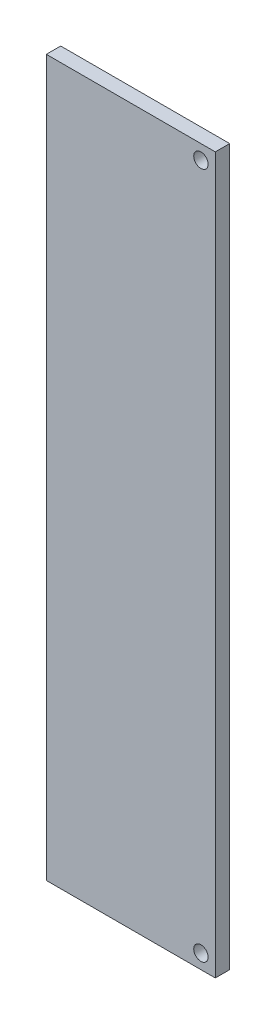
ISO-10303-21;
HEADER;
FILE_DESCRIPTION(('STEP AP214'),'2;1');
FILE_NAME('part.step','',(''),(''),'','','');
FILE_SCHEMA(('AUTOMOTIVE_DESIGN { 1 0 10303 214 1 1 1 1 }'));
ENDSEC;
DATA;
#1=APPLICATION_CONTEXT('core data for automotive mechanical design processes');
#2=APPLICATION_PROTOCOL_DEFINITION('international standard','automotive_design',2000,#1);
#3=PRODUCT_CONTEXT('',#1,'mechanical');
#4=PRODUCT('Part','Part','',(#3));
#5=PRODUCT_RELATED_PRODUCT_CATEGORY('part','',(#4));
#6=PRODUCT_DEFINITION_FORMATION('','',#4);
#7=PRODUCT_DEFINITION_CONTEXT('part definition',#1,'design');
#8=PRODUCT_DEFINITION('design','',#6,#7);
#9=PRODUCT_DEFINITION_SHAPE('','',#8);
#10=(LENGTH_UNIT() NAMED_UNIT(*) SI_UNIT(.MILLI.,.METRE.));
#11=(NAMED_UNIT(*) PLANE_ANGLE_UNIT() SI_UNIT($,.RADIAN.));
#12=(NAMED_UNIT(*) SI_UNIT($,.STERADIAN.) SOLID_ANGLE_UNIT());
#13=UNCERTAINTY_MEASURE_WITH_UNIT(LENGTH_MEASURE(1.E-05),#10,'distance_accuracy_value','');
#14=(GEOMETRIC_REPRESENTATION_CONTEXT(3) GLOBAL_UNCERTAINTY_ASSIGNED_CONTEXT((#13)) GLOBAL_UNIT_ASSIGNED_CONTEXT((#10,
#11,#12)) REPRESENTATION_CONTEXT('',''));
#15=CARTESIAN_POINT('',(0.,0.,0.));
#16=DIRECTION('',(0.,0.,1.));
#17=DIRECTION('',(1.,0.,0.));
#18=AXIS2_PLACEMENT_3D('',#15,#16,#17);
#19=CARTESIAN_POINT('',(-57.,36.,2.));
#20=DIRECTION('',(1.,0.,0.));
#21=DIRECTION('',(0.,1.,0.));
#22=AXIS2_PLACEMENT_3D('',#19,#20,#21);
#23=PLANE('',#22);
#24=DIRECTION('',(0.,-1.,0.));
#25=VECTOR('',#24,1.);
#26=CARTESIAN_POINT('',(-57.,36.,0.));
#27=LINE('',#26,#25);
#28=CARTESIAN_POINT('',(-57.,36.,0.));
#29=VERTEX_POINT('',#28);
#30=CARTESIAN_POINT('',(-57.,-63.5,0.));
#31=VERTEX_POINT('',#30);
#32=EDGE_CURVE('E106',#29,#31,#27,.T.);
#33=ORIENTED_EDGE('',*,*,#32,.T.);
#34=DIRECTION('',(0.,0.,-1.));
#35=VECTOR('',#34,1.);
#36=CARTESIAN_POINT('',(-57.,-63.5,2.));
#37=LINE('',#36,#35);
#38=CARTESIAN_POINT('',(-57.,-63.5,2.));
#39=VERTEX_POINT('',#38);
#40=EDGE_CURVE('E11',#39,#31,#37,.T.);
#41=ORIENTED_EDGE('',*,*,#40,.F.);
#42=DIRECTION('',(0.,-1.,0.));
#43=VECTOR('',#42,1.);
#44=CARTESIAN_POINT('',(-57.,36.,2.));
#45=LINE('',#44,#43);
#46=CARTESIAN_POINT('',(-57.,36.,2.));
#47=VERTEX_POINT('',#46);
#48=EDGE_CURVE('E90',#47,#39,#45,.T.);
#49=ORIENTED_EDGE('',*,*,#48,.F.);
#50=DIRECTION('',(0.,0.,-1.));
#51=VECTOR('',#50,1.);
#52=CARTESIAN_POINT('',(-57.,36.,2.));
#53=LINE('',#52,#51);
#54=EDGE_CURVE('E102',#47,#29,#53,.T.);
#55=ORIENTED_EDGE('',*,*,#54,.T.);
#56=EDGE_LOOP('',(#33,#41,#49,#55));
#57=FACE_BOUND('',#56,.T.);
#58=ADVANCED_FACE('F38',(#57),#23,.F.);
#59=CARTESIAN_POINT('',(-57.,-63.5,2.));
#60=DIRECTION('',(0.,1.,0.));
#61=DIRECTION('',(-1.,0.,0.));
#62=AXIS2_PLACEMENT_3D('',#59,#60,#61);
#63=PLANE('',#62);
#64=DIRECTION('',(1.,0.,0.));
#65=VECTOR('',#64,1.);
#66=CARTESIAN_POINT('',(-57.,-63.5,0.));
#67=LINE('',#66,#65);
#68=CARTESIAN_POINT('',(-33.5,-63.5,0.));
#69=VERTEX_POINT('',#68);
#70=EDGE_CURVE('E95',#31,#69,#67,.T.);
#71=ORIENTED_EDGE('',*,*,#70,.T.);
#72=DIRECTION('',(0.,0.,-1.));
#73=VECTOR('',#72,1.);
#74=CARTESIAN_POINT('',(-33.5,-63.5,2.));
#75=LINE('',#74,#73);
#76=CARTESIAN_POINT('',(-33.5,-63.5,2.));
#77=VERTEX_POINT('',#76);
#78=EDGE_CURVE('E47',#77,#69,#75,.T.);
#79=ORIENTED_EDGE('',*,*,#78,.F.);
#80=DIRECTION('',(1.,0.,0.));
#81=VECTOR('',#80,1.);
#82=CARTESIAN_POINT('',(-57.,-63.5,2.));
#83=LINE('',#82,#81);
#84=EDGE_CURVE('E85',#39,#77,#83,.T.);
#85=ORIENTED_EDGE('',*,*,#84,.F.);
#86=ORIENTED_EDGE('',*,*,#40,.T.);
#87=EDGE_LOOP('',(#71,#79,#85,#86));
#88=FACE_BOUND('',#87,.T.);
#89=ADVANCED_FACE('F94',(#88),#63,.F.);
#90=CARTESIAN_POINT('',(-33.5,36.,2.));
#91=DIRECTION('',(-1.,0.,0.));
#92=DIRECTION('',(0.,0.,1.));
#93=AXIS2_PLACEMENT_3D('',#90,#91,#92);
#94=PLANE('',#93);
#95=DIRECTION('',(0.,1.,0.));
#96=VECTOR('',#95,1.);
#97=CARTESIAN_POINT('',(-33.5,36.,0.));
#98=LINE('',#97,#96);
#99=CARTESIAN_POINT('',(-33.5,36.,0.));
#100=VERTEX_POINT('',#99);
#101=EDGE_CURVE('E72',#69,#100,#98,.T.);
#102=ORIENTED_EDGE('',*,*,#101,.T.);
#103=DIRECTION('',(0.,0.,-1.));
#104=VECTOR('',#103,1.);
#105=CARTESIAN_POINT('',(-33.5,36.,2.));
#106=LINE('',#105,#104);
#107=CARTESIAN_POINT('',(-33.5,36.,2.));
#108=VERTEX_POINT('',#107);
#109=EDGE_CURVE('E97',#108,#100,#106,.T.);
#110=ORIENTED_EDGE('',*,*,#109,.F.);
#111=DIRECTION('',(0.,1.,0.));
#112=VECTOR('',#111,1.);
#113=CARTESIAN_POINT('',(-33.5,36.,2.));
#114=LINE('',#113,#112);
#115=EDGE_CURVE('E88',#77,#108,#114,.T.);
#116=ORIENTED_EDGE('',*,*,#115,.F.);
#117=ORIENTED_EDGE('',*,*,#78,.T.);
#118=EDGE_LOOP('',(#102,#110,#116,#117));
#119=FACE_BOUND('',#118,.T.);
#120=ADVANCED_FACE('F98',(#119),#94,.F.);
#121=CARTESIAN_POINT('',(-57.,36.,2.));
#122=DIRECTION('',(0.,-1.,0.));
#123=DIRECTION('',(0.,0.,-1.));
#124=AXIS2_PLACEMENT_3D('',#121,#122,#123);
#125=PLANE('',#124);
#126=DIRECTION('',(-1.,0.,0.));
#127=VECTOR('',#126,1.);
#128=CARTESIAN_POINT('',(-57.,36.,0.));
#129=LINE('',#128,#127);
#130=EDGE_CURVE('E78',#100,#29,#129,.T.);
#131=ORIENTED_EDGE('',*,*,#130,.T.);
#132=ORIENTED_EDGE('',*,*,#54,.F.);
#133=DIRECTION('',(-1.,0.,0.));
#134=VECTOR('',#133,1.);
#135=CARTESIAN_POINT('',(-57.,36.,2.));
#136=LINE('',#135,#134);
#137=EDGE_CURVE('E55',#108,#47,#136,.T.);
#138=ORIENTED_EDGE('',*,*,#137,.F.);
#139=ORIENTED_EDGE('',*,*,#109,.T.);
#140=EDGE_LOOP('',(#131,#132,#138,#139));
#141=FACE_BOUND('',#140,.T.);
#142=ADVANCED_FACE('F120',(#141),#125,.F.);
#143=CARTESIAN_POINT('',(0.,0.,2.));
#144=DIRECTION('',(0.,0.,1.));
#145=DIRECTION('',(1.,0.,0.));
#146=AXIS2_PLACEMENT_3D('',#143,#144,#145);
#147=PLANE('',#146);
#148=CARTESIAN_POINT('',(-35.5,34.,2.));
#149=DIRECTION('',(0.,0.,1.));
#150=DIRECTION('',(1.,0.,0.));
#151=AXIS2_PLACEMENT_3D('',#148,#149,#150);
#152=CIRCLE('',#151,0.999999999999998);
#153=CARTESIAN_POINT('',(-34.5,34.,2.));
#154=VERTEX_POINT('',#153);
#155=EDGE_CURVE('E135',#154,#154,#152,.T.);
#156=ORIENTED_EDGE('',*,*,#155,.F.);
#157=EDGE_LOOP('',(#156));
#158=FACE_BOUND('',#157,.T.);
#159=CARTESIAN_POINT('',(-35.5,-61.5,2.));
#160=DIRECTION('',(0.,0.,1.));
#161=DIRECTION('',(1.,0.,0.));
#162=AXIS2_PLACEMENT_3D('',#159,#160,#161);
#163=CIRCLE('',#162,0.999999999999998);
#164=CARTESIAN_POINT('',(-34.5,-61.5,2.));
#165=VERTEX_POINT('',#164);
#166=EDGE_CURVE('E127',#165,#165,#163,.T.);
#167=ORIENTED_EDGE('',*,*,#166,.F.);
#168=EDGE_LOOP('',(#167));
#169=FACE_BOUND('',#168,.T.);
#170=ORIENTED_EDGE('',*,*,#48,.T.);
#171=ORIENTED_EDGE('',*,*,#84,.T.);
#172=ORIENTED_EDGE('',*,*,#115,.T.);
#173=ORIENTED_EDGE('',*,*,#137,.T.);
#174=EDGE_LOOP('',(#170,#171,#172,#173));
#175=FACE_BOUND('',#174,.T.);
#176=ADVANCED_FACE('F86',(#158,#169,#175),#147,.T.);
#177=CARTESIAN_POINT('',(0.,0.,0.));
#178=DIRECTION('',(0.,0.,1.));
#179=DIRECTION('',(1.,0.,0.));
#180=AXIS2_PLACEMENT_3D('',#177,#178,#179);
#181=PLANE('',#180);
#182=CARTESIAN_POINT('',(-35.5,34.,0.));
#183=DIRECTION('',(0.,0.,1.));
#184=DIRECTION('',(1.,0.,0.));
#185=AXIS2_PLACEMENT_3D('',#182,#183,#184);
#186=CIRCLE('',#185,0.999999999999998);
#187=CARTESIAN_POINT('',(-34.5,34.,0.));
#188=VERTEX_POINT('',#187);
#189=EDGE_CURVE('E110',#188,#188,#186,.T.);
#190=ORIENTED_EDGE('',*,*,#189,.T.);
#191=EDGE_LOOP('',(#190));
#192=FACE_BOUND('',#191,.T.);
#193=CARTESIAN_POINT('',(-35.5,-61.5,0.));
#194=DIRECTION('',(0.,0.,1.));
#195=DIRECTION('',(1.,0.,0.));
#196=AXIS2_PLACEMENT_3D('',#193,#194,#195);
#197=CIRCLE('',#196,0.999999999999998);
#198=CARTESIAN_POINT('',(-34.5,-61.5,0.));
#199=VERTEX_POINT('',#198);
#200=EDGE_CURVE('E131',#199,#199,#197,.T.);
#201=ORIENTED_EDGE('',*,*,#200,.T.);
#202=EDGE_LOOP('',(#201));
#203=FACE_BOUND('',#202,.T.);
#204=ORIENTED_EDGE('',*,*,#32,.F.);
#205=ORIENTED_EDGE('',*,*,#130,.F.);
#206=ORIENTED_EDGE('',*,*,#101,.F.);
#207=ORIENTED_EDGE('',*,*,#70,.F.);
#208=EDGE_LOOP('',(#204,#205,#206,#207));
#209=FACE_BOUND('',#208,.T.);
#210=ADVANCED_FACE('F123',(#192,#203,#209),#181,.F.);
#211=CARTESIAN_POINT('',(-35.5,-61.5,0.));
#212=DIRECTION('',(0.,0.,1.));
#213=DIRECTION('',(1.,0.,0.));
#214=AXIS2_PLACEMENT_3D('',#211,#212,#213);
#215=CYLINDRICAL_SURFACE('',#214,0.999999999999998);
#216=ORIENTED_EDGE('',*,*,#200,.F.);
#217=EDGE_LOOP('',(#216));
#218=FACE_BOUND('',#217,.T.);
#219=ORIENTED_EDGE('',*,*,#166,.T.);
#220=EDGE_LOOP('',(#219));
#221=FACE_BOUND('',#220,.T.);
#222=ADVANCED_FACE('F148',(#218,#221),#215,.F.);
#223=CARTESIAN_POINT('',(-35.5,34.,0.));
#224=DIRECTION('',(0.,0.,1.));
#225=DIRECTION('',(1.,0.,0.));
#226=AXIS2_PLACEMENT_3D('',#223,#224,#225);
#227=CYLINDRICAL_SURFACE('',#226,0.999999999999998);
#228=ORIENTED_EDGE('',*,*,#189,.F.);
#229=EDGE_LOOP('',(#228));
#230=FACE_BOUND('',#229,.T.);
#231=ORIENTED_EDGE('',*,*,#155,.T.);
#232=EDGE_LOOP('',(#231));
#233=FACE_BOUND('',#232,.T.);
#234=ADVANCED_FACE('F145',(#230,#233),#227,.F.);
#235=CLOSED_SHELL('',(#58,#89,#120,#142,#176,#210,#222,#234));
#236=MANIFOLD_SOLID_BREP('B2',#235);
#237=ADVANCED_BREP_SHAPE_REPRESENTATION('',(#18,#236),#14);
#238=SHAPE_DEFINITION_REPRESENTATION(#9,#237);
ENDSEC;
END-ISO-10303-21;
